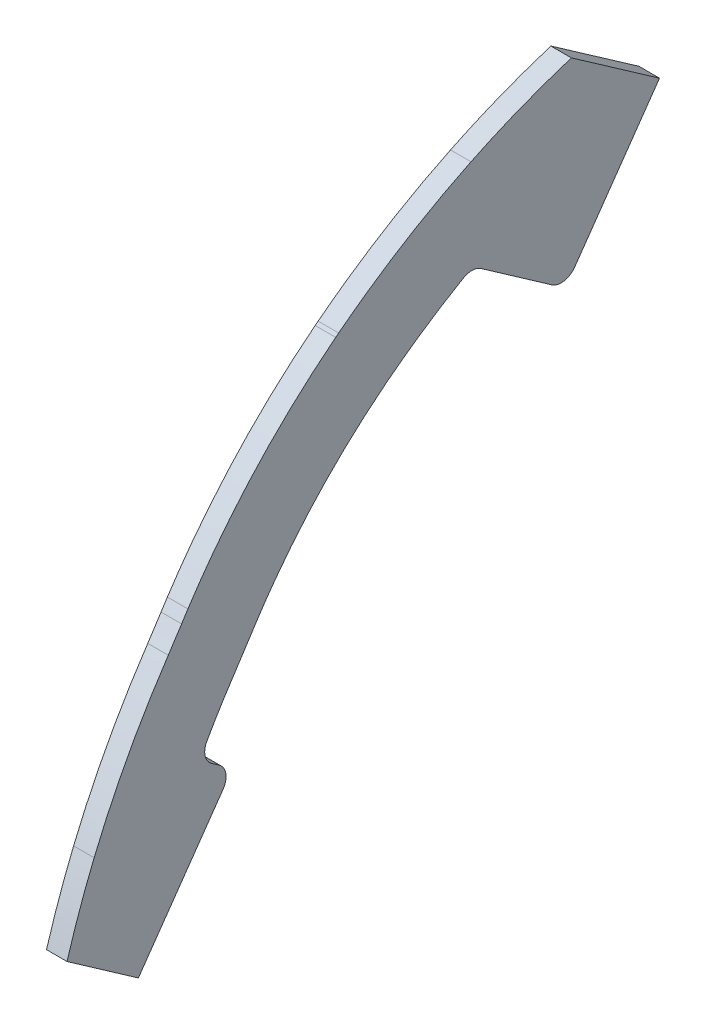
ISO-10303-21;
HEADER;
FILE_DESCRIPTION(('STEP AP214'),'2;1');
FILE_NAME('part.step','',(''),(''),'','','');
FILE_SCHEMA(('AUTOMOTIVE_DESIGN { 1 0 10303 214 1 1 1 1 }'));
ENDSEC;
DATA;
#1=APPLICATION_CONTEXT('core data for automotive mechanical design processes');
#2=APPLICATION_PROTOCOL_DEFINITION('international standard','automotive_design',2000,#1);
#3=PRODUCT_CONTEXT('',#1,'mechanical');
#4=PRODUCT('Part','Part','',(#3));
#5=PRODUCT_RELATED_PRODUCT_CATEGORY('part','',(#4));
#6=PRODUCT_DEFINITION_FORMATION('','',#4);
#7=PRODUCT_DEFINITION_CONTEXT('part definition',#1,'design');
#8=PRODUCT_DEFINITION('design','',#6,#7);
#9=PRODUCT_DEFINITION_SHAPE('','',#8);
#10=(LENGTH_UNIT() NAMED_UNIT(*) SI_UNIT(.MILLI.,.METRE.));
#11=(NAMED_UNIT(*) PLANE_ANGLE_UNIT() SI_UNIT($,.RADIAN.));
#12=(NAMED_UNIT(*) SI_UNIT($,.STERADIAN.) SOLID_ANGLE_UNIT());
#13=UNCERTAINTY_MEASURE_WITH_UNIT(LENGTH_MEASURE(1.E-05),#10,'distance_accuracy_value','');
#14=(GEOMETRIC_REPRESENTATION_CONTEXT(3) GLOBAL_UNCERTAINTY_ASSIGNED_CONTEXT((#13)) GLOBAL_UNIT_ASSIGNED_CONTEXT((#10,
#11,#12)) REPRESENTATION_CONTEXT('',''));
#15=CARTESIAN_POINT('',(0.,0.,0.));
#16=DIRECTION('',(0.,0.,1.));
#17=DIRECTION('',(1.,0.,0.));
#18=AXIS2_PLACEMENT_3D('',#15,#16,#17);
#19=CARTESIAN_POINT('',(-1.5875,107.915935417137,86.5173654967509));
#20=CARTESIAN_POINT('',(-1.5875,101.90193271907,90.5708923696763));
#21=CARTESIAN_POINT('',(-1.5875,95.4836107019876,94.0088634744107));
#22=CARTESIAN_POINT('',(-1.5875,88.7800683957772,96.7767882945236));
#23=B_SPLINE_CURVE_WITH_KNOTS('',3,(#19,#20,#21,#22),.UNSPECIFIED.,.F.,.F.,(4,4),(0.,1.),.UNSPECIFIED.);
#24=DIRECTION('',(1.,0.,0.));
#25=VECTOR('',#24,1.);
#26=SURFACE_OF_LINEAR_EXTRUSION('',#23,#25);
#27=CARTESIAN_POINT('',(1.5875,107.915935417137,86.5173654967509));
#28=CARTESIAN_POINT('',(1.5875,105.504268415559,88.1428647674094));
#29=CARTESIAN_POINT('',(1.5875,103.027583663719,89.6693777929756));
#30=CARTESIAN_POINT('',(1.5875,100.493561306121,91.0933907325681));
#31=B_SPLINE_CURVE_WITH_KNOTS('',3,(#27,#28,#29,#30),.UNSPECIFIED.,.F.,.F.,(4,4),(0.,
0.401008633127777),.UNSPECIFIED.);
#32=CARTESIAN_POINT('',(1.5875,107.915935417137,86.5173654967509));
#33=VERTEX_POINT('',#32);
#34=CARTESIAN_POINT('',(1.5875,100.493569679058,91.0934056331087));
#35=VERTEX_POINT('',#34);
#36=EDGE_CURVE('E427',#33,#35,#31,.T.);
#37=ORIENTED_EDGE('',*,*,#36,.T.);
#38=DIRECTION('',(1.,0.,0.));
#39=VECTOR('',#38,1.);
#40=CARTESIAN_POINT('',(1.5875,100.493561306526,91.0933907323403));
#41=LINE('',#40,#39);
#42=CARTESIAN_POINT('',(-1.5875,100.493569679058,91.0934056331087));
#43=VERTEX_POINT('',#42);
#44=EDGE_CURVE('E63',#35,#43,#41,.F.);
#45=ORIENTED_EDGE('',*,*,#44,.T.);
#46=CARTESIAN_POINT('',(-1.5875,100.493561305716,91.093390732796));
#47=CARTESIAN_POINT('',(-1.5875,103.027583663455,89.6693777931384));
#48=CARTESIAN_POINT('',(-1.5875,105.50426841543,88.1428647674961));
#49=CARTESIAN_POINT('',(-1.5875,107.915935417137,86.5173654967509));
#50=B_SPLINE_CURVE_WITH_KNOTS('',3,(#46,#47,#48,#49),.UNSPECIFIED.,.F.,.F.,(4,4),(0.,
0.401008633149162),.UNSPECIFIED.);
#51=CARTESIAN_POINT('',(-1.5875,107.915935417137,86.5173654967509));
#52=VERTEX_POINT('',#51);
#53=EDGE_CURVE('E373',#52,#43,#50,.F.);
#54=ORIENTED_EDGE('',*,*,#53,.F.);
#55=DIRECTION('',(1.,0.,0.));
#56=VECTOR('',#55,1.);
#57=CARTESIAN_POINT('',(-1.5875,107.915935417137,86.5173654967509));
#58=LINE('',#57,#56);
#59=EDGE_CURVE('E415',#52,#33,#58,.T.);
#60=ORIENTED_EDGE('',*,*,#59,.T.);
#61=EDGE_LOOP('',(#37,#45,#54,#60));
#62=FACE_BOUND('',#61,.T.);
#63=ADVANCED_FACE('F41',(#62),#26,.F.);
#64=CARTESIAN_POINT('',(1.5875,93.6270317100952,108.515482712118));
#65=CARTESIAN_POINT('',(1.5875,88.0312485824802,110.826008494565));
#66=CARTESIAN_POINT('',(1.5875,82.2656921555576,112.729048559774));
#67=CARTESIAN_POINT('',(1.5875,76.3893372673394,114.202129114204));
#68=(BOUNDED_CURVE() B_SPLINE_CURVE(3,(#64,#65,#66,#67),.UNSPECIFIED.,.F.,
.F.) B_SPLINE_CURVE_WITH_KNOTS((4,4),(0.,1.),
.UNSPECIFIED.) CURVE() GEOMETRIC_REPRESENTATION_ITEM() RATIONAL_B_SPLINE_CURVE((1.,1.,1.,1.)) REPRESENTATION_ITEM(''));
#69=DIRECTION('',(-1.,0.,0.));
#70=VECTOR('',#69,1.);
#71=SURFACE_OF_LINEAR_EXTRUSION('',#68,#70);
#72=DIRECTION('',(-1.,0.,0.));
#73=VECTOR('',#72,1.);
#74=CARTESIAN_POINT('',(2.2225,81.825546879038,112.707408993808));
#75=LINE('',#74,#73);
#76=CARTESIAN_POINT('',(1.5875,81.825546879038,112.707408993808));
#77=VERTEX_POINT('',#76);
#78=CARTESIAN_POINT('',(-1.5875,81.825546879038,112.707408993808));
#79=VERTEX_POINT('',#78);
#80=EDGE_CURVE('E208',#77,#79,#75,.T.);
#81=ORIENTED_EDGE('',*,*,#80,.F.);
#82=CARTESIAN_POINT('',(1.5875,93.627031710095,108.515482712118));
#83=VERTEX_POINT('',#82);
#84=EDGE_CURVE('E625',#83,#77,#68,.T.);
#85=ORIENTED_EDGE('',*,*,#84,.F.);
#86=DIRECTION('',(-1.,0.,0.));
#87=VECTOR('',#86,1.);
#88=CARTESIAN_POINT('',(1.5875,93.627031710095,108.515482712118));
#89=LINE('',#88,#87);
#90=CARTESIAN_POINT('',(-1.5875,93.627031710095,108.515482712118));
#91=VERTEX_POINT('',#90);
#92=EDGE_CURVE('E618',#83,#91,#89,.T.);
#93=ORIENTED_EDGE('',*,*,#92,.T.);
#94=CARTESIAN_POINT('',(-1.5875,93.6270317100952,108.515482712118));
#95=CARTESIAN_POINT('',(-1.5875,88.0312485824802,110.826008494565));
#96=CARTESIAN_POINT('',(-1.5875,82.2656921555576,112.729048559774));
#97=CARTESIAN_POINT('',(-1.5875,76.3893372673394,114.202129114204));
#98=(BOUNDED_CURVE() B_SPLINE_CURVE(3,(#94,#95,#96,#97),.UNSPECIFIED.,.F.,
.F.) B_SPLINE_CURVE_WITH_KNOTS((4,4),(0.,1.),
.UNSPECIFIED.) CURVE() GEOMETRIC_REPRESENTATION_ITEM() RATIONAL_B_SPLINE_CURVE((1.,1.,1.,1.)) REPRESENTATION_ITEM(''));
#99=EDGE_CURVE('E603',#91,#79,#98,.T.);
#100=ORIENTED_EDGE('',*,*,#99,.T.);
#101=EDGE_LOOP('',(#81,#85,#93,#100));
#102=FACE_BOUND('',#101,.T.);
#103=ADVANCED_FACE('F337',(#102),#71,.F.);
#104=CARTESIAN_POINT('',(1.5875,0.,0.));
#105=DIRECTION('',(1.,0.,0.));
#106=DIRECTION('',(0.,0.,-1.));
#107=AXIS2_PLACEMENT_3D('',#104,#105,#106);
#108=PLANE('',#107);
#109=DIRECTION('',(0.,0.819152044288991,-0.573576436351047));
#110=VECTOR('',#109,1.);
#111=CARTESIAN_POINT('',(1.5875,72.1527943640414,103.044869451879));
#112=LINE('',#111,#110);
#113=CARTESIAN_POINT('',(1.5875,74.103391567662,101.679047281967));
#114=VERTEX_POINT('',#113);
#115=CARTESIAN_POINT('',(1.5875,92.8292159019509,88.5670832278332));
#116=VERTEX_POINT('',#115);
#117=EDGE_CURVE('E223',#114,#116,#112,.T.);
#118=ORIENTED_EDGE('',*,*,#117,.T.);
#119=CARTESIAN_POINT('',(1.5875,94.2861000502826,90.6477294203273));
#120=DIRECTION('',(1.,0.,0.));
#121=DIRECTION('',(0.,0.,-1.));
#122=AXIS2_PLACEMENT_3D('',#119,#120,#121);
#123=CIRCLE('',#122,2.54);
#124=CARTESIAN_POINT('',(1.5875,96.3667462427766,89.1908452719956));
#125=VERTEX_POINT('',#124);
#126=EDGE_CURVE('E260',#116,#125,#123,.T.);
#127=ORIENTED_EDGE('',*,*,#126,.T.);
#128=DIRECTION('',(0.,0.573576436351047,0.819152044288991));
#129=VECTOR('',#128,1.);
#130=CARTESIAN_POINT('',(1.5875,22.7570677304036,-15.9346703723775));
#131=LINE('',#130,#129);
#132=CARTESIAN_POINT('',(1.5875,97.1685641585946,90.3359599302412));
#133=VERTEX_POINT('',#132);
#134=EDGE_CURVE('E230',#125,#133,#131,.T.);
#135=ORIENTED_EDGE('',*,*,#134,.T.);
#136=CARTESIAN_POINT('',(1.5875,99.2492103510886,88.8790757819095));
#137=DIRECTION('',(1.,0.,0.));
#138=DIRECTION('',(0.,0.,-1.));
#139=AXIS2_PLACEMENT_3D('',#136,#137,#138);
#140=CIRCLE('',#139,2.54);
#141=EDGE_CURVE('E50',#133,#35,#140,.F.);
#142=ORIENTED_EDGE('',*,*,#141,.T.);
#143=ORIENTED_EDGE('',*,*,#36,.F.);
#144=CARTESIAN_POINT('',(1.5875,111.419873636231,84.2359800322319));
#145=CARTESIAN_POINT('',(1.5875,110.239821867848,84.9777158691664));
#146=CARTESIAN_POINT('',(1.5875,109.071717042518,85.7383516115718));
#147=CARTESIAN_POINT('',(1.5875,107.915935417137,86.5173654967509));
#148=B_SPLINE_CURVE_WITH_KNOTS('',3,(#144,#145,#146,#147),.UNSPECIFIED.,.F.,.F.,(4,4),(0.,1.),.UNSPECIFIED.);
#149=CARTESIAN_POINT('',(1.5875,111.419873630809,84.2359800236039));
#150=VERTEX_POINT('',#149);
#151=EDGE_CURVE('E458',#150,#33,#148,.T.);
#152=ORIENTED_EDGE('',*,*,#151,.F.);
#153=CARTESIAN_POINT('',(1.5875,63.3548181596361,7.75744346018917));
#154=DIRECTION('',(1.,0.,0.));
#155=DIRECTION('',(0.,0.,-1.));
#156=AXIS2_PLACEMENT_3D('',#153,#154,#155);
#157=CIRCLE('',#156,90.3283793296906);
#158=CARTESIAN_POINT('',(1.5875,112.752426785171,83.3821244351593));
#159=VERTEX_POINT('',#158);
#160=EDGE_CURVE('E462',#159,#150,#157,.T.);
#161=ORIENTED_EDGE('',*,*,#160,.F.);
#162=CARTESIAN_POINT('',(1.5875,134.648212731086,63.3161076207928));
#163=CARTESIAN_POINT('',(1.5875,133.111065715405,65.2730000841247));
#164=CARTESIAN_POINT('',(1.5875,131.496958998954,67.1625498269264));
#165=CARTESIAN_POINT('',(1.5875,128.116527434619,70.8084525487401));
#166=CARTESIAN_POINT('',(1.5875,126.350531472869,72.5639139832837));
#167=CARTESIAN_POINT('',(1.5875,122.686873255702,75.9213637440467));
#168=CARTESIAN_POINT('',(1.5875,120.783823873835,77.5282254514782));
#169=CARTESIAN_POINT('',(1.5875,116.858338681864,80.5777798165875));
#170=CARTESIAN_POINT('',(1.5875,114.835703472595,82.021159666385));
#171=CARTESIAN_POINT('',(1.5875,112.752426785171,83.3821244351593));
#172=B_SPLINE_CURVE_WITH_KNOTS('',3,(#162,#163,#164,#165,#166,#167,#168,#169,#170,#171),
.UNSPECIFIED.,.F.,.F.,(4,2,2,2,4),(0.,0.25,0.5,0.75,1.),.UNSPECIFIED.);
#173=CARTESIAN_POINT('',(1.5875,134.64821273107,63.3161076207793));
#174=VERTEX_POINT('',#173);
#175=EDGE_CURVE('E470',#174,#159,#172,.T.);
#176=ORIENTED_EDGE('',*,*,#175,.F.);
#177=CARTESIAN_POINT('',(1.5875,134.967702358971,62.9074683058939));
#178=CARTESIAN_POINT('',(1.5875,134.861587146926,63.0439788888338));
#179=CARTESIAN_POINT('',(1.5875,134.755018246043,63.1801364229118));
#180=CARTESIAN_POINT('',(1.5875,134.64821273107,63.3161076207793));
#181=B_SPLINE_CURVE_WITH_KNOTS('',3,(#177,#178,#179,#180),.UNSPECIFIED.,.F.,.F.,(4,4),(0.,
0.000518710128432478),.UNSPECIFIED.);
#182=CARTESIAN_POINT('',(1.5875,134.967702358965,62.9074683058897));
#183=VERTEX_POINT('',#182);
#184=EDGE_CURVE('E547',#183,#174,#181,.T.);
#185=ORIENTED_EDGE('',*,*,#184,.F.);
#186=CARTESIAN_POINT('',(1.5875,142.718267340774,51.3892971924271));
#187=CARTESIAN_POINT('',(1.5875,140.4007841171,55.3985494249314));
#188=CARTESIAN_POINT('',(1.5875,137.811365186794,59.2492822621669));
#189=CARTESIAN_POINT('',(1.5875,134.967702358965,62.9074683058897));
#190=B_SPLINE_CURVE_WITH_KNOTS('',3,(#186,#187,#188,#189),.UNSPECIFIED.,.F.,.F.,(4,4),
(0.352340620145685,1.),.UNSPECIFIED.);
#191=CARTESIAN_POINT('',(1.5875,142.71829839717,51.3893151452742));
#192=VERTEX_POINT('',#191);
#193=EDGE_CURVE('E541',#192,#183,#190,.T.);
#194=ORIENTED_EDGE('',*,*,#193,.F.);
#195=CARTESIAN_POINT('',(1.5875,140.519213956038,50.1181700504458));
#196=DIRECTION('',(1.,0.,0.));
#197=DIRECTION('',(0.,0.,-1.));
#198=AXIS2_PLACEMENT_3D('',#195,#196,#197);
#199=CIRCLE('',#198,2.54);
#200=CARTESIAN_POINT('',(1.5875,142.599860148532,48.6612859021142));
#201=VERTEX_POINT('',#200);
#202=EDGE_CURVE('E273',#192,#201,#199,.F.);
#203=ORIENTED_EDGE('',*,*,#202,.T.);
#204=DIRECTION('',(0.,0.573576436351047,0.819152044288991));
#205=VECTOR('',#204,1.);
#206=CARTESIAN_POINT('',(1.5875,72.8226167372914,-50.9909451916081));
#207=LINE('',#206,#205);
#208=CARTESIAN_POINT('',(1.5875,134.953392567289,37.7409984673444));
#209=VERTEX_POINT('',#208);
#210=EDGE_CURVE('E214',#209,#201,#207,.T.);
#211=ORIENTED_EDGE('',*,*,#210,.F.);
#212=CARTESIAN_POINT('',(1.5875,137.034038759783,36.2841143190127));
#213=DIRECTION('',(1.,0.,0.));
#214=DIRECTION('',(0.,0.,-1.));
#215=AXIS2_PLACEMENT_3D('',#212,#213,#214);
#216=CIRCLE('',#215,2.54);
#217=CARTESIAN_POINT('',(1.5875,135.577154611452,34.2034681265187));
#218=VERTEX_POINT('',#217);
#219=EDGE_CURVE('E258',#209,#218,#216,.T.);
#220=ORIENTED_EDGE('',*,*,#219,.T.);
#221=DIRECTION('',(0.,-0.819152044288991,0.573576436351047));
#222=VECTOR('',#221,1.);
#223=CARTESIAN_POINT('',(1.5875,60.6738916816663,86.6512974664585));
#224=LINE('',#223,#222);
#225=CARTESIAN_POINT('',(1.5875,154.311490018694,21.0921927756359));
#226=VERTEX_POINT('',#225);
#227=EDGE_CURVE('E254',#226,#218,#224,.T.);
#228=ORIENTED_EDGE('',*,*,#227,.F.);
#229=DIRECTION('',(0.,-0.573576436351047,-0.819152044288991));
#230=VECTOR('',#229,1.);
#231=CARTESIAN_POINT('',(1.5875,93.6290786622317,-65.5597866749247));
#232=LINE('',#231,#230);
#233=CARTESIAN_POINT('',(1.5875,163.847355212807,34.722305017646));
#234=VERTEX_POINT('',#233);
#235=EDGE_CURVE('E793',#234,#226,#232,.T.);
#236=ORIENTED_EDGE('',*,*,#235,.F.);
#237=CARTESIAN_POINT('',(1.5875,169.18994581688,-8.75182657063168E-09));
#238=CARTESIAN_POINT('',(1.5875,169.189794661323,13.0067356295379));
#239=CARTESIAN_POINT('',(1.5875,167.235783234296,26.0150387116111));
#240=CARTESIAN_POINT('',(1.5875,163.333674627763,38.5625912605726));
#241=CARTESIAN_POINT('',(1.5875,157.690613368795,50.2374657150393));
#242=(BOUNDED_CURVE() B_SPLINE_CURVE(4,(#237,#238,#239,#240,#241),.UNSPECIFIED.,.F.,
.F.) B_SPLINE_CURVE_WITH_KNOTS((5,5),(0.,1.),
.UNSPECIFIED.) CURVE() GEOMETRIC_REPRESENTATION_ITEM() RATIONAL_B_SPLINE_CURVE((1.,1.,1.,1.,1.)) REPRESENTATION_ITEM(''));
#243=CARTESIAN_POINT('',(1.5875,157.690613368795,50.2374657150393));
#244=VERTEX_POINT('',#243);
#245=EDGE_CURVE('E606',#234,#244,#242,.T.);
#246=ORIENTED_EDGE('',*,*,#245,.T.);
#247=CARTESIAN_POINT('',(1.5875,157.690613368795,50.2374657150393));
#248=CARTESIAN_POINT('',(1.5875,154.185304199465,57.4895836956331));
#249=CARTESIAN_POINT('',(1.5875,149.921691806846,64.3634008386052));
#250=CARTESIAN_POINT('',(1.5875,144.994599704752,70.7017822344691));
#251=(BOUNDED_CURVE() B_SPLINE_CURVE(3,(#247,#248,#249,#250),.UNSPECIFIED.,.F.,
.F.) B_SPLINE_CURVE_WITH_KNOTS((4,4),(0.,1.),
.UNSPECIFIED.) CURVE() GEOMETRIC_REPRESENTATION_ITEM() RATIONAL_B_SPLINE_CURVE((1.,1.,1.,1.)) REPRESENTATION_ITEM(''));
#252=CARTESIAN_POINT('',(1.5875,144.994599704752,70.7017822344691));
#253=VERTEX_POINT('',#252);
#254=EDGE_CURVE('E649',#244,#253,#251,.T.);
#255=ORIENTED_EDGE('',*,*,#254,.T.);
#256=CARTESIAN_POINT('',(1.5875,144.994599704752,70.7017822344691));
#257=CARTESIAN_POINT('',(1.5875,144.875309775761,70.8552412666994));
#258=CARTESIAN_POINT('',(1.5875,144.755529232783,71.0083060491197));
#259=CARTESIAN_POINT('',(1.5875,144.635475433697,71.1611432299567));
#260=(BOUNDED_CURVE() B_SPLINE_CURVE(3,(#256,#257,#258,#259),.UNSPECIFIED.,.F.,
.F.) B_SPLINE_CURVE_WITH_KNOTS((4,4),(0.,1.),
.UNSPECIFIED.) CURVE() GEOMETRIC_REPRESENTATION_ITEM() RATIONAL_B_SPLINE_CURVE((1.,1.,1.,1.)) REPRESENTATION_ITEM(''));
#261=CARTESIAN_POINT('',(1.5875,144.635475433697,71.1611432299567));
#262=VERTEX_POINT('',#261);
#263=EDGE_CURVE('E740',#253,#262,#260,.T.);
#264=ORIENTED_EDGE('',*,*,#263,.T.);
#265=CARTESIAN_POINT('',(1.5875,144.635475433697,71.1611432299567));
#266=CARTESIAN_POINT('',(1.5875,137.608784490994,80.1065976384552));
#267=CARTESIAN_POINT('',(1.5875,129.14774479477,87.841288267326));
#268=CARTESIAN_POINT('',(1.5875,119.697960171294,94.0146013861083));
#269=(BOUNDED_CURVE() B_SPLINE_CURVE(3,(#265,#266,#267,#268),.UNSPECIFIED.,.F.,
.F.) B_SPLINE_CURVE_WITH_KNOTS((4,4),(0.,1.),
.UNSPECIFIED.) CURVE() GEOMETRIC_REPRESENTATION_ITEM() RATIONAL_B_SPLINE_CURVE((1.,1.,1.,1.)) REPRESENTATION_ITEM(''));
#270=CARTESIAN_POINT('',(1.5875,119.697960171294,94.0146013861083));
#271=VERTEX_POINT('',#270);
#272=EDGE_CURVE('E735',#262,#271,#269,.T.);
#273=ORIENTED_EDGE('',*,*,#272,.T.);
#274=CARTESIAN_POINT('',(1.5875,63.3548181596361,7.75744346018917));
#275=DIRECTION('',(1.,0.,0.));
#276=DIRECTION('',(0.,0.,-1.));
#277=AXIS2_PLACEMENT_3D('',#274,#275,#276);
#278=CIRCLE('',#277,103.0283793195);
#279=CARTESIAN_POINT('',(1.5875,118.178380489188,94.9883093202763));
#280=VERTEX_POINT('',#279);
#281=EDGE_CURVE('E739',#271,#280,#278,.T.);
#282=ORIENTED_EDGE('',*,*,#281,.T.);
#283=CARTESIAN_POINT('',(1.5875,118.178380489188,94.9883093202763));
#284=CARTESIAN_POINT('',(1.5875,117.116005214424,95.6560781713368));
#285=CARTESIAN_POINT('',(1.5875,116.060431913398,96.3433169268643));
#286=CARTESIAN_POINT('',(1.5875,115.014111075737,97.0485526244997));
#287=(BOUNDED_CURVE() B_SPLINE_CURVE(3,(#283,#284,#285,#286),.UNSPECIFIED.,.F.,
.F.) B_SPLINE_CURVE_WITH_KNOTS((4,4),(0.,1.),
.UNSPECIFIED.) CURVE() GEOMETRIC_REPRESENTATION_ITEM() RATIONAL_B_SPLINE_CURVE((1.,1.,1.,1.)) REPRESENTATION_ITEM(''));
#288=CARTESIAN_POINT('',(1.5875,115.014111075737,97.0485526244997));
#289=VERTEX_POINT('',#288);
#290=EDGE_CURVE('E698',#280,#289,#287,.T.);
#291=ORIENTED_EDGE('',*,*,#290,.T.);
#292=CARTESIAN_POINT('',(1.5875,115.014111075737,97.0485526244998));
#293=CARTESIAN_POINT('',(1.5875,108.292402496115,101.579083741193));
#294=CARTESIAN_POINT('',(1.5875,101.116024349716,105.423241676263));
#295=CARTESIAN_POINT('',(1.5875,93.627031710095,108.515482712118));
#296=(BOUNDED_CURVE() B_SPLINE_CURVE(3,(#292,#293,#294,#295),.UNSPECIFIED.,.F.,
.F.) B_SPLINE_CURVE_WITH_KNOTS((4,4),(0.,1.),
.UNSPECIFIED.) CURVE() GEOMETRIC_REPRESENTATION_ITEM() RATIONAL_B_SPLINE_CURVE((1.,1.,1.,1.)) REPRESENTATION_ITEM(''));
#297=EDGE_CURVE('E696',#289,#83,#296,.T.);
#298=ORIENTED_EDGE('',*,*,#297,.T.);
#299=ORIENTED_EDGE('',*,*,#84,.T.);
#300=DIRECTION('',(0.,-0.573576436351047,-0.819152044288991));
#301=VECTOR('',#300,1.);
#302=CARTESIAN_POINT('',(1.5875,1.95060580546317,-1.36582888906094));
#303=LINE('',#302,#301);
#304=EDGE_CURVE('E548',#77,#114,#303,.T.);
#305=ORIENTED_EDGE('',*,*,#304,.T.);
#306=EDGE_LOOP('',(#118,#127,#135,#142,#143,#152,#161,#176,#185,#194,#203,#211,#220,#228,#236,
#246,#255,#264,#273,#282,#291,#298,#299,#305));
#307=FACE_BOUND('',#306,.T.);
#308=ADVANCED_FACE('F299',(#307),#108,.T.);
#309=CARTESIAN_POINT('',(-1.5875,0.,0.));
#310=DIRECTION('',(1.,0.,0.));
#311=DIRECTION('',(0.,0.,-1.));
#312=AXIS2_PLACEMENT_3D('',#309,#310,#311);
#313=PLANE('',#312);
#314=DIRECTION('',(0.,0.573576436351047,0.819152044288991));
#315=VECTOR('',#314,1.);
#316=CARTESIAN_POINT('',(-1.5875,22.7570677304036,-15.9346703723775));
#317=LINE('',#316,#315);
#318=CARTESIAN_POINT('',(-1.5875,96.3667462427766,89.1908452719956));
#319=VERTEX_POINT('',#318);
#320=CARTESIAN_POINT('',(-1.5875,97.1685641585946,90.3359599302412));
#321=VERTEX_POINT('',#320);
#322=EDGE_CURVE('E231',#319,#321,#317,.T.);
#323=ORIENTED_EDGE('',*,*,#322,.F.);
#324=CARTESIAN_POINT('',(-1.5875,94.2861000502826,90.6477294203273));
#325=DIRECTION('',(1.,0.,0.));
#326=DIRECTION('',(0.,0.,-1.));
#327=AXIS2_PLACEMENT_3D('',#324,#325,#326);
#328=CIRCLE('',#327,2.54);
#329=CARTESIAN_POINT('',(-1.5875,92.8292159019509,88.5670832278332));
#330=VERTEX_POINT('',#329);
#331=EDGE_CURVE('E229',#319,#330,#328,.F.);
#332=ORIENTED_EDGE('',*,*,#331,.T.);
#333=DIRECTION('',(0.,0.819152044288991,-0.573576436351047));
#334=VECTOR('',#333,1.);
#335=CARTESIAN_POINT('',(-1.5875,72.1527943640414,103.044869451879));
#336=LINE('',#335,#334);
#337=CARTESIAN_POINT('',(-1.5875,74.1033829658194,101.679054001116));
#338=VERTEX_POINT('',#337);
#339=EDGE_CURVE('E220',#338,#330,#336,.T.);
#340=ORIENTED_EDGE('',*,*,#339,.F.);
#341=DIRECTION('',(0.,0.573576436351047,0.819152044288991));
#342=VECTOR('',#341,1.);
#343=CARTESIAN_POINT('',(-1.5875,1.95060580546317,-1.36582888906094));
#344=LINE('',#343,#342);
#345=EDGE_CURVE('E202',#338,#79,#344,.T.);
#346=ORIENTED_EDGE('',*,*,#345,.T.);
#347=ORIENTED_EDGE('',*,*,#99,.F.);
#348=CARTESIAN_POINT('',(-1.5875,115.014111075737,97.0485526244998));
#349=CARTESIAN_POINT('',(-1.5875,108.292402496115,101.579083741193));
#350=CARTESIAN_POINT('',(-1.5875,101.116024349716,105.423241676263));
#351=CARTESIAN_POINT('',(-1.5875,93.627031710095,108.515482712118));
#352=(BOUNDED_CURVE() B_SPLINE_CURVE(3,(#348,#349,#350,#351),.UNSPECIFIED.,.F.,
.F.) B_SPLINE_CURVE_WITH_KNOTS((4,4),(0.,1.),
.UNSPECIFIED.) CURVE() GEOMETRIC_REPRESENTATION_ITEM() RATIONAL_B_SPLINE_CURVE((1.,1.,1.,1.)) REPRESENTATION_ITEM(''));
#353=CARTESIAN_POINT('',(-1.5875,115.014111075737,97.0485526244997));
#354=VERTEX_POINT('',#353);
#355=EDGE_CURVE('E607',#354,#91,#352,.T.);
#356=ORIENTED_EDGE('',*,*,#355,.F.);
#357=CARTESIAN_POINT('',(-1.5875,118.178380489188,94.9883093202763));
#358=CARTESIAN_POINT('',(-1.5875,117.116005214424,95.6560781713368));
#359=CARTESIAN_POINT('',(-1.5875,116.060431913398,96.3433169268643));
#360=CARTESIAN_POINT('',(-1.5875,115.014111075737,97.0485526244997));
#361=(BOUNDED_CURVE() B_SPLINE_CURVE(3,(#357,#358,#359,#360),.UNSPECIFIED.,.F.,
.F.) B_SPLINE_CURVE_WITH_KNOTS((4,4),(0.,1.),
.UNSPECIFIED.) CURVE() GEOMETRIC_REPRESENTATION_ITEM() RATIONAL_B_SPLINE_CURVE((1.,1.,1.,1.)) REPRESENTATION_ITEM(''));
#362=CARTESIAN_POINT('',(-1.5875,118.178380489188,94.9883093202763));
#363=VERTEX_POINT('',#362);
#364=EDGE_CURVE('E680',#363,#354,#361,.T.);
#365=ORIENTED_EDGE('',*,*,#364,.F.);
#366=CARTESIAN_POINT('',(-1.5875,63.3548181596361,7.75744346018917));
#367=DIRECTION('',(1.,0.,0.));
#368=DIRECTION('',(0.,0.,-1.));
#369=AXIS2_PLACEMENT_3D('',#366,#367,#368);
#370=CIRCLE('',#369,103.0283793195);
#371=CARTESIAN_POINT('',(-1.5875,119.697960171294,94.0146013861083));
#372=VERTEX_POINT('',#371);
#373=EDGE_CURVE('E676',#372,#363,#370,.T.);
#374=ORIENTED_EDGE('',*,*,#373,.F.);
#375=CARTESIAN_POINT('',(-1.5875,144.635475433697,71.1611432299567));
#376=CARTESIAN_POINT('',(-1.5875,137.608784490994,80.1065976384552));
#377=CARTESIAN_POINT('',(-1.5875,129.14774479477,87.841288267326));
#378=CARTESIAN_POINT('',(-1.5875,119.697960171294,94.0146013861083));
#379=(BOUNDED_CURVE() B_SPLINE_CURVE(3,(#375,#376,#377,#378),.UNSPECIFIED.,.F.,
.F.) B_SPLINE_CURVE_WITH_KNOTS((4,4),(0.,1.),
.UNSPECIFIED.) CURVE() GEOMETRIC_REPRESENTATION_ITEM() RATIONAL_B_SPLINE_CURVE((1.,1.,1.,1.)) REPRESENTATION_ITEM(''));
#380=CARTESIAN_POINT('',(-1.5875,144.635475433697,71.1611432299567));
#381=VERTEX_POINT('',#380);
#382=EDGE_CURVE('E657',#381,#372,#379,.T.);
#383=ORIENTED_EDGE('',*,*,#382,.F.);
#384=CARTESIAN_POINT('',(-1.5875,144.994599704752,70.7017822344691));
#385=CARTESIAN_POINT('',(-1.5875,144.875309775761,70.8552412666994));
#386=CARTESIAN_POINT('',(-1.5875,144.755529232783,71.0083060491197));
#387=CARTESIAN_POINT('',(-1.5875,144.635475433697,71.1611432299567));
#388=(BOUNDED_CURVE() B_SPLINE_CURVE(3,(#384,#385,#386,#387),.UNSPECIFIED.,.F.,
.F.) B_SPLINE_CURVE_WITH_KNOTS((4,4),(0.,1.),
.UNSPECIFIED.) CURVE() GEOMETRIC_REPRESENTATION_ITEM() RATIONAL_B_SPLINE_CURVE((1.,1.,1.,1.)) REPRESENTATION_ITEM(''));
#389=CARTESIAN_POINT('',(-1.5875,144.994599704752,70.7017822344691));
#390=VERTEX_POINT('',#389);
#391=EDGE_CURVE('E655',#390,#381,#388,.T.);
#392=ORIENTED_EDGE('',*,*,#391,.F.);
#393=CARTESIAN_POINT('',(-1.5875,157.690613368795,50.2374657150393));
#394=CARTESIAN_POINT('',(-1.5875,154.185304199465,57.4895836956331));
#395=CARTESIAN_POINT('',(-1.5875,149.921691806846,64.3634008386052));
#396=CARTESIAN_POINT('',(-1.5875,144.994599704752,70.7017822344691));
#397=(BOUNDED_CURVE() B_SPLINE_CURVE(3,(#393,#394,#395,#396),.UNSPECIFIED.,.F.,
.F.) B_SPLINE_CURVE_WITH_KNOTS((4,4),(0.,1.),
.UNSPECIFIED.) CURVE() GEOMETRIC_REPRESENTATION_ITEM() RATIONAL_B_SPLINE_CURVE((1.,1.,1.,1.)) REPRESENTATION_ITEM(''));
#398=CARTESIAN_POINT('',(-1.5875,157.690613368795,50.2374657150393));
#399=VERTEX_POINT('',#398);
#400=EDGE_CURVE('E648',#399,#390,#397,.T.);
#401=ORIENTED_EDGE('',*,*,#400,.F.);
#402=CARTESIAN_POINT('',(-1.5875,169.18994581688,-8.75182657063168E-09));
#403=CARTESIAN_POINT('',(-1.5875,169.189794661323,13.0067356295379));
#404=CARTESIAN_POINT('',(-1.5875,167.235783234296,26.0150387116111));
#405=CARTESIAN_POINT('',(-1.5875,163.333674627763,38.5625912605726));
#406=CARTESIAN_POINT('',(-1.5875,157.690613368795,50.2374657150393));
#407=(BOUNDED_CURVE() B_SPLINE_CURVE(4,(#402,#403,#404,#405,#406),.UNSPECIFIED.,.F.,
.F.) B_SPLINE_CURVE_WITH_KNOTS((5,5),(0.,1.),
.UNSPECIFIED.) CURVE() GEOMETRIC_REPRESENTATION_ITEM() RATIONAL_B_SPLINE_CURVE((1.,1.,1.,1.,1.)) REPRESENTATION_ITEM(''));
#408=CARTESIAN_POINT('',(-1.5875,163.847355212807,34.722305017646));
#409=VERTEX_POINT('',#408);
#410=EDGE_CURVE('E422',#409,#399,#407,.T.);
#411=ORIENTED_EDGE('',*,*,#410,.F.);
#412=DIRECTION('',(0.,0.573576436351047,0.819152044288991));
#413=VECTOR('',#412,1.);
#414=CARTESIAN_POINT('',(-1.5875,93.6290786622317,-65.5597866749247));
#415=LINE('',#414,#413);
#416=CARTESIAN_POINT('',(-1.5875,154.320009695778,21.0928747589566));
#417=VERTEX_POINT('',#416);
#418=EDGE_CURVE('E213',#417,#409,#415,.T.);
#419=ORIENTED_EDGE('',*,*,#418,.F.);
#420=DIRECTION('',(0.,-0.819152044288991,0.573576436351047));
#421=VECTOR('',#420,1.);
#422=CARTESIAN_POINT('',(-1.5875,60.6738916816663,86.6512974664585));
#423=LINE('',#422,#421);
#424=CARTESIAN_POINT('',(-1.5875,135.577154611452,34.2034681265187));
#425=VERTEX_POINT('',#424);
#426=EDGE_CURVE('E243',#417,#425,#423,.T.);
#427=ORIENTED_EDGE('',*,*,#426,.T.);
#428=CARTESIAN_POINT('',(-1.5875,137.034038759783,36.2841143190127));
#429=DIRECTION('',(1.,0.,0.));
#430=DIRECTION('',(0.,0.,-1.));
#431=AXIS2_PLACEMENT_3D('',#428,#429,#430);
#432=CIRCLE('',#431,2.54);
#433=CARTESIAN_POINT('',(-1.5875,134.953392567289,37.7409984673444));
#434=VERTEX_POINT('',#433);
#435=EDGE_CURVE('E303',#425,#434,#432,.F.);
#436=ORIENTED_EDGE('',*,*,#435,.T.);
#437=DIRECTION('',(0.,0.573576436351047,0.819152044288991));
#438=VECTOR('',#437,1.);
#439=CARTESIAN_POINT('',(-1.5875,72.8226167372914,-50.9909451916081));
#440=LINE('',#439,#438);
#441=CARTESIAN_POINT('',(-1.5875,142.599860148532,48.6612859021142));
#442=VERTEX_POINT('',#441);
#443=EDGE_CURVE('E307',#434,#442,#440,.T.);
#444=ORIENTED_EDGE('',*,*,#443,.T.);
#445=CARTESIAN_POINT('',(-1.5875,140.519213956038,50.1181700504458));
#446=DIRECTION('',(1.,0.,0.));
#447=DIRECTION('',(0.,0.,-1.));
#448=AXIS2_PLACEMENT_3D('',#445,#446,#447);
#449=CIRCLE('',#448,2.54);
#450=CARTESIAN_POINT('',(-1.5875,142.71829839717,51.3893151452742));
#451=VERTEX_POINT('',#450);
#452=EDGE_CURVE('E277',#442,#451,#449,.T.);
#453=ORIENTED_EDGE('',*,*,#452,.T.);
#454=CARTESIAN_POINT('',(-1.5875,134.967702358965,62.9074683058897));
#455=CARTESIAN_POINT('',(-1.5875,137.811365186581,59.2492822624407));
#456=CARTESIAN_POINT('',(-1.5875,140.400784116712,55.3985494255079));
#457=CARTESIAN_POINT('',(-1.5875,142.718267340253,51.3892971933275));
#458=B_SPLINE_CURVE_WITH_KNOTS('',3,(#454,#455,#456,#457),.UNSPECIFIED.,.F.,.F.,(4,4),
(0.352340620194166,1.),.UNSPECIFIED.);
#459=CARTESIAN_POINT('',(-1.5875,134.967702358965,62.9074683058897));
#460=VERTEX_POINT('',#459);
#461=EDGE_CURVE('E314',#451,#460,#458,.F.);
#462=ORIENTED_EDGE('',*,*,#461,.T.);
#463=CARTESIAN_POINT('',(-1.5875,134.64821273107,63.3161076207793));
#464=CARTESIAN_POINT('',(-1.5875,134.755018246043,63.1801364229118));
#465=CARTESIAN_POINT('',(-1.5875,134.861587146926,63.0439788888338));
#466=CARTESIAN_POINT('',(-1.5875,134.967702358971,62.9074683058939));
#467=B_SPLINE_CURVE_WITH_KNOTS('',3,(#463,#464,#465,#466),.UNSPECIFIED.,.F.,.F.,(4,4),(0.,
0.000518710128432478),.UNSPECIFIED.);
#468=CARTESIAN_POINT('',(-1.5875,134.64821273107,63.3161076207793));
#469=VERTEX_POINT('',#468);
#470=EDGE_CURVE('E553',#460,#469,#467,.F.);
#471=ORIENTED_EDGE('',*,*,#470,.T.);
#472=CARTESIAN_POINT('',(-1.5875,112.752426785171,83.3821244351593));
#473=CARTESIAN_POINT('',(-1.5875,114.835703472595,82.021159666385));
#474=CARTESIAN_POINT('',(-1.5875,116.858338681864,80.5777798165875));
#475=CARTESIAN_POINT('',(-1.5875,120.783823873835,77.5282254514782));
#476=CARTESIAN_POINT('',(-1.5875,122.686873255702,75.9213637440467));
#477=CARTESIAN_POINT('',(-1.5875,126.350531472869,72.5639139832837));
#478=CARTESIAN_POINT('',(-1.5875,128.116527434619,70.8084525487401));
#479=CARTESIAN_POINT('',(-1.5875,131.496958998954,67.1625498269264));
#480=CARTESIAN_POINT('',(-1.5875,133.111065715405,65.2730000841247));
#481=CARTESIAN_POINT('',(-1.5875,134.648212731086,63.3161076207928));
#482=B_SPLINE_CURVE_WITH_KNOTS('',3,(#472,#473,#474,#475,#476,#477,#478,#479,#480,#481),
.UNSPECIFIED.,.F.,.F.,(4,2,2,2,4),(0.,0.25,0.5,0.75,1.),.UNSPECIFIED.);
#483=CARTESIAN_POINT('',(-1.5875,112.752426785171,83.3821244351593));
#484=VERTEX_POINT('',#483);
#485=EDGE_CURVE('E452',#469,#484,#482,.F.);
#486=ORIENTED_EDGE('',*,*,#485,.T.);
#487=CARTESIAN_POINT('',(-1.5875,63.3548181596361,7.75744346018917));
#488=DIRECTION('',(1.,0.,0.));
#489=DIRECTION('',(0.,0.,-1.));
#490=AXIS2_PLACEMENT_3D('',#487,#488,#489);
#491=CIRCLE('',#490,90.3283793296906);
#492=CARTESIAN_POINT('',(-1.5875,111.419873630809,84.2359800236039));
#493=VERTEX_POINT('',#492);
#494=EDGE_CURVE('E450',#484,#493,#491,.T.);
#495=ORIENTED_EDGE('',*,*,#494,.T.);
#496=CARTESIAN_POINT('',(-1.5875,107.915935417137,86.5173654967509));
#497=CARTESIAN_POINT('',(-1.5875,109.071717042518,85.7383516115718));
#498=CARTESIAN_POINT('',(-1.5875,110.239821867848,84.9777158691664));
#499=CARTESIAN_POINT('',(-1.5875,111.419873636231,84.2359800322319));
#500=B_SPLINE_CURVE_WITH_KNOTS('',3,(#496,#497,#498,#499),.UNSPECIFIED.,.F.,.F.,(4,4),(0.,1.),.UNSPECIFIED.);
#501=EDGE_CURVE('E365',#493,#52,#500,.F.);
#502=ORIENTED_EDGE('',*,*,#501,.T.);
#503=ORIENTED_EDGE('',*,*,#53,.T.);
#504=CARTESIAN_POINT('',(-1.5875,99.2492103510886,88.8790757819095));
#505=DIRECTION('',(1.,0.,0.));
#506=DIRECTION('',(0.,0.,-1.));
#507=AXIS2_PLACEMENT_3D('',#504,#505,#506);
#508=CIRCLE('',#507,2.54);
#509=EDGE_CURVE('E11',#43,#321,#508,.T.);
#510=ORIENTED_EDGE('',*,*,#509,.T.);
#511=EDGE_LOOP('',(#323,#332,#340,#346,#347,#356,#365,#374,#383,#392,#401,#411,#419,#427,#436,
#444,#453,#462,#471,#486,#495,#502,#503,#510));
#512=FACE_BOUND('',#511,.T.);
#513=ADVANCED_FACE('F228',(#512),#313,.F.);
#514=DIRECTION('',(-1.,0.,0.));
#515=VECTOR('',#514,1.);
#516=SURFACE_OF_LINEAR_EXTRUSION('',#242,#515);
#517=ORIENTED_EDGE('',*,*,#245,.F.);
#518=DIRECTION('',(-1.,0.,0.));
#519=VECTOR('',#518,1.);
#520=CARTESIAN_POINT('',(2.2225,163.847355212807,34.722305017646));
#521=LINE('',#520,#519);
#522=EDGE_CURVE('E794',#234,#409,#521,.T.);
#523=ORIENTED_EDGE('',*,*,#522,.T.);
#524=ORIENTED_EDGE('',*,*,#410,.T.);
#525=DIRECTION('',(-1.,0.,0.));
#526=VECTOR('',#525,1.);
#527=CARTESIAN_POINT('',(1.5875,157.690613368795,50.2374657150393));
#528=LINE('',#527,#526);
#529=EDGE_CURVE('E322',#244,#399,#528,.T.);
#530=ORIENTED_EDGE('',*,*,#529,.F.);
#531=EDGE_LOOP('',(#517,#523,#524,#530));
#532=FACE_BOUND('',#531,.T.);
#533=ADVANCED_FACE('F334',(#532),#516,.F.);
#534=DIRECTION('',(-1.,0.,0.));
#535=VECTOR('',#534,1.);
#536=SURFACE_OF_LINEAR_EXTRUSION('',#251,#535);
#537=ORIENTED_EDGE('',*,*,#400,.T.);
#538=DIRECTION('',(-1.,0.,0.));
#539=VECTOR('',#538,1.);
#540=CARTESIAN_POINT('',(1.5875,144.994599704752,70.7017822344691));
#541=LINE('',#540,#539);
#542=EDGE_CURVE('E636',#253,#390,#541,.T.);
#543=ORIENTED_EDGE('',*,*,#542,.F.);
#544=ORIENTED_EDGE('',*,*,#254,.F.);
#545=ORIENTED_EDGE('',*,*,#529,.T.);
#546=EDGE_LOOP('',(#537,#543,#544,#545));
#547=FACE_BOUND('',#546,.T.);
#548=ADVANCED_FACE('F647',(#547),#536,.F.);
#549=DIRECTION('',(-1.,0.,0.));
#550=VECTOR('',#549,1.);
#551=SURFACE_OF_LINEAR_EXTRUSION('',#260,#550);
#552=ORIENTED_EDGE('',*,*,#391,.T.);
#553=DIRECTION('',(-1.,0.,0.));
#554=VECTOR('',#553,1.);
#555=CARTESIAN_POINT('',(1.5875,144.635475433697,71.1611432299567));
#556=LINE('',#555,#554);
#557=EDGE_CURVE('E634',#262,#381,#556,.T.);
#558=ORIENTED_EDGE('',*,*,#557,.F.);
#559=ORIENTED_EDGE('',*,*,#263,.F.);
#560=ORIENTED_EDGE('',*,*,#542,.T.);
#561=EDGE_LOOP('',(#552,#558,#559,#560));
#562=FACE_BOUND('',#561,.T.);
#563=ADVANCED_FACE('F731',(#562),#551,.F.);
#564=DIRECTION('',(-1.,0.,0.));
#565=VECTOR('',#564,1.);
#566=SURFACE_OF_LINEAR_EXTRUSION('',#269,#565);
#567=ORIENTED_EDGE('',*,*,#382,.T.);
#568=DIRECTION('',(-1.,0.,0.));
#569=VECTOR('',#568,1.);
#570=CARTESIAN_POINT('',(1.5875,119.697960171294,94.0146013861083));
#571=LINE('',#570,#569);
#572=EDGE_CURVE('E631',#271,#372,#571,.T.);
#573=ORIENTED_EDGE('',*,*,#572,.F.);
#574=ORIENTED_EDGE('',*,*,#272,.F.);
#575=ORIENTED_EDGE('',*,*,#557,.T.);
#576=EDGE_LOOP('',(#567,#573,#574,#575));
#577=FACE_BOUND('',#576,.T.);
#578=ADVANCED_FACE('F726',(#577),#566,.F.);
#579=CARTESIAN_POINT('',(1.5875,63.3548181596361,7.75744346018917));
#580=DIRECTION('',(-1.,0.,0.));
#581=DIRECTION('',(0.,0.,1.));
#582=AXIS2_PLACEMENT_3D('',#579,#580,#581);
#583=CYLINDRICAL_SURFACE('',#582,103.0283793195);
#584=ORIENTED_EDGE('',*,*,#373,.T.);
#585=DIRECTION('',(-1.,0.,0.));
#586=VECTOR('',#585,1.);
#587=CARTESIAN_POINT('',(1.5875,118.178380489188,94.9883093202763));
#588=LINE('',#587,#586);
#589=EDGE_CURVE('E628',#280,#363,#588,.T.);
#590=ORIENTED_EDGE('',*,*,#589,.F.);
#591=ORIENTED_EDGE('',*,*,#281,.F.);
#592=ORIENTED_EDGE('',*,*,#572,.T.);
#593=EDGE_LOOP('',(#584,#590,#591,#592));
#594=FACE_BOUND('',#593,.T.);
#595=ADVANCED_FACE('F723',(#594),#583,.T.);
#596=DIRECTION('',(-1.,0.,0.));
#597=VECTOR('',#596,1.);
#598=SURFACE_OF_LINEAR_EXTRUSION('',#287,#597);
#599=ORIENTED_EDGE('',*,*,#364,.T.);
#600=DIRECTION('',(-1.,0.,0.));
#601=VECTOR('',#600,1.);
#602=CARTESIAN_POINT('',(1.5875,115.014111075737,97.0485526244997));
#603=LINE('',#602,#601);
#604=EDGE_CURVE('E624',#289,#354,#603,.T.);
#605=ORIENTED_EDGE('',*,*,#604,.F.);
#606=ORIENTED_EDGE('',*,*,#290,.F.);
#607=ORIENTED_EDGE('',*,*,#589,.T.);
#608=EDGE_LOOP('',(#599,#605,#606,#607));
#609=FACE_BOUND('',#608,.T.);
#610=ADVANCED_FACE('F720',(#609),#598,.F.);
#611=DIRECTION('',(-1.,0.,0.));
#612=VECTOR('',#611,1.);
#613=SURFACE_OF_LINEAR_EXTRUSION('',#296,#612);
#614=ORIENTED_EDGE('',*,*,#355,.T.);
#615=ORIENTED_EDGE('',*,*,#92,.F.);
#616=ORIENTED_EDGE('',*,*,#297,.F.);
#617=ORIENTED_EDGE('',*,*,#604,.T.);
#618=EDGE_LOOP('',(#614,#615,#616,#617));
#619=FACE_BOUND('',#618,.T.);
#620=ADVANCED_FACE('F692',(#619),#613,.F.);
#621=CARTESIAN_POINT('',(-1.5875,111.419873636231,84.2359800322319));
#622=CARTESIAN_POINT('',(-1.5875,110.239821867848,84.9777158691664));
#623=CARTESIAN_POINT('',(-1.5875,109.071717042518,85.7383516115718));
#624=CARTESIAN_POINT('',(-1.5875,107.915935417137,86.5173654967509));
#625=B_SPLINE_CURVE_WITH_KNOTS('',3,(#621,#622,#623,#624),.UNSPECIFIED.,.F.,.F.,(4,4),(0.,1.),.UNSPECIFIED.);
#626=DIRECTION('',(1.,0.,0.));
#627=VECTOR('',#626,1.);
#628=SURFACE_OF_LINEAR_EXTRUSION('',#625,#627);
#629=ORIENTED_EDGE('',*,*,#151,.T.);
#630=ORIENTED_EDGE('',*,*,#59,.F.);
#631=ORIENTED_EDGE('',*,*,#501,.F.);
#632=DIRECTION('',(1.,0.,0.));
#633=VECTOR('',#632,1.);
#634=CARTESIAN_POINT('',(-1.5875,111.419873630809,84.2359800236039));
#635=LINE('',#634,#633);
#636=EDGE_CURVE('E423',#493,#150,#635,.T.);
#637=ORIENTED_EDGE('',*,*,#636,.T.);
#638=EDGE_LOOP('',(#629,#630,#631,#637));
#639=FACE_BOUND('',#638,.T.);
#640=ADVANCED_FACE('F396',(#639),#628,.F.);
#641=CARTESIAN_POINT('',(-1.5875,63.3548181596361,7.75744346018917));
#642=DIRECTION('',(1.,0.,0.));
#643=DIRECTION('',(0.,0.,-1.));
#644=AXIS2_PLACEMENT_3D('',#641,#642,#643);
#645=CYLINDRICAL_SURFACE('',#644,90.3283793296906);
#646=ORIENTED_EDGE('',*,*,#160,.T.);
#647=ORIENTED_EDGE('',*,*,#636,.F.);
#648=ORIENTED_EDGE('',*,*,#494,.F.);
#649=DIRECTION('',(1.,0.,0.));
#650=VECTOR('',#649,1.);
#651=CARTESIAN_POINT('',(-1.5875,112.752426785171,83.3821244351593));
#652=LINE('',#651,#650);
#653=EDGE_CURVE('E447',#484,#159,#652,.T.);
#654=ORIENTED_EDGE('',*,*,#653,.T.);
#655=EDGE_LOOP('',(#646,#647,#648,#654));
#656=FACE_BOUND('',#655,.T.);
#657=ADVANCED_FACE('F492',(#656),#645,.F.);
#658=CARTESIAN_POINT('',(-1.5875,134.648212731086,63.3161076207928));
#659=CARTESIAN_POINT('',(-1.5875,133.111065715405,65.2730000841247));
#660=CARTESIAN_POINT('',(-1.5875,131.496958998954,67.1625498269264));
#661=CARTESIAN_POINT('',(-1.5875,128.116527434619,70.8084525487401));
#662=CARTESIAN_POINT('',(-1.5875,126.350531472869,72.5639139832837));
#663=CARTESIAN_POINT('',(-1.5875,122.686873255702,75.9213637440467));
#664=CARTESIAN_POINT('',(-1.5875,120.783823873835,77.5282254514782));
#665=CARTESIAN_POINT('',(-1.5875,116.858338681864,80.5777798165875));
#666=CARTESIAN_POINT('',(-1.5875,114.835703472595,82.021159666385));
#667=CARTESIAN_POINT('',(-1.5875,112.752426785171,83.3821244351593));
#668=B_SPLINE_CURVE_WITH_KNOTS('',3,(#658,#659,#660,#661,#662,#663,#664,#665,#666,#667),
.UNSPECIFIED.,.F.,.F.,(4,2,2,2,4),(0.,0.25,0.5,0.75,1.),.UNSPECIFIED.);
#669=DIRECTION('',(1.,0.,0.));
#670=VECTOR('',#669,1.);
#671=SURFACE_OF_LINEAR_EXTRUSION('',#668,#670);
#672=ORIENTED_EDGE('',*,*,#175,.T.);
#673=ORIENTED_EDGE('',*,*,#653,.F.);
#674=ORIENTED_EDGE('',*,*,#485,.F.);
#675=DIRECTION('',(1.,0.,0.));
#676=VECTOR('',#675,1.);
#677=CARTESIAN_POINT('',(-1.5875,134.64821273107,63.3161076207793));
#678=LINE('',#677,#676);
#679=EDGE_CURVE('E480',#469,#174,#678,.T.);
#680=ORIENTED_EDGE('',*,*,#679,.T.);
#681=EDGE_LOOP('',(#672,#673,#674,#680));
#682=FACE_BOUND('',#681,.T.);
#683=ADVANCED_FACE('F482',(#682),#671,.F.);
#684=CARTESIAN_POINT('',(-1.5875,134.967702358971,62.9074683058939));
#685=CARTESIAN_POINT('',(-1.5875,134.861587146926,63.0439788888338));
#686=CARTESIAN_POINT('',(-1.5875,134.755018246043,63.1801364229118));
#687=CARTESIAN_POINT('',(-1.5875,134.64821273107,63.3161076207793));
#688=B_SPLINE_CURVE_WITH_KNOTS('',3,(#684,#685,#686,#687),.UNSPECIFIED.,.F.,.F.,(4,4),(0.,
0.000518710128432478),.UNSPECIFIED.);
#689=DIRECTION('',(1.,0.,0.));
#690=VECTOR('',#689,1.);
#691=SURFACE_OF_LINEAR_EXTRUSION('',#688,#690);
#692=ORIENTED_EDGE('',*,*,#184,.T.);
#693=ORIENTED_EDGE('',*,*,#679,.F.);
#694=ORIENTED_EDGE('',*,*,#470,.F.);
#695=DIRECTION('',(1.,0.,0.));
#696=VECTOR('',#695,1.);
#697=CARTESIAN_POINT('',(-1.5875,134.967702358965,62.9074683058897));
#698=LINE('',#697,#696);
#699=EDGE_CURVE('E375',#460,#183,#698,.T.);
#700=ORIENTED_EDGE('',*,*,#699,.T.);
#701=EDGE_LOOP('',(#692,#693,#694,#700));
#702=FACE_BOUND('',#701,.T.);
#703=ADVANCED_FACE('F491',(#702),#691,.F.);
#704=CARTESIAN_POINT('',(-1.5875,146.256255065299,44.7106718716546));
#705=CARTESIAN_POINT('',(-1.5875,143.142937334555,51.1518005720792));
#706=CARTESIAN_POINT('',(-1.5875,139.358378872394,57.2591504438899));
#707=CARTESIAN_POINT('',(-1.5875,134.967702358965,62.9074683058897));
#708=B_SPLINE_CURVE_WITH_KNOTS('',3,(#704,#705,#706,#707),.UNSPECIFIED.,.F.,.F.,(4,4),(0.,1.),.UNSPECIFIED.);
#709=DIRECTION('',(1.,0.,0.));
#710=VECTOR('',#709,1.);
#711=SURFACE_OF_LINEAR_EXTRUSION('',#708,#710);
#712=ORIENTED_EDGE('',*,*,#461,.F.);
#713=DIRECTION('',(1.,0.,0.));
#714=VECTOR('',#713,1.);
#715=CARTESIAN_POINT('',(-1.5875,142.718267341294,51.3892971915268));
#716=LINE('',#715,#714);
#717=EDGE_CURVE('E270',#451,#192,#716,.T.);
#718=ORIENTED_EDGE('',*,*,#717,.T.);
#719=ORIENTED_EDGE('',*,*,#193,.T.);
#720=ORIENTED_EDGE('',*,*,#699,.F.);
#721=EDGE_LOOP('',(#712,#718,#719,#720));
#722=FACE_BOUND('',#721,.T.);
#723=ADVANCED_FACE('F518',(#722),#711,.F.);
#724=CARTESIAN_POINT('',(2.2225,93.6290786622317,-65.5597866749247));
#725=DIRECTION('',(0.,-0.819152044288991,0.573576436351047));
#726=DIRECTION('',(0.,-0.573576436351047,-0.819152044288991));
#727=AXIS2_PLACEMENT_3D('',#724,#725,#726);
#728=PLANE('',#727);
#729=ORIENTED_EDGE('',*,*,#235,.T.);
#730=DIRECTION('',(1.,0.,0.));
#731=VECTOR('',#730,1.);
#732=CARTESIAN_POINT('',(-1.5875,154.302970343898,21.0915107915338));
#733=LINE('',#732,#731);
#734=EDGE_CURVE('E225',#226,#417,#733,.F.);
#735=ORIENTED_EDGE('',*,*,#734,.T.);
#736=ORIENTED_EDGE('',*,*,#418,.T.);
#737=ORIENTED_EDGE('',*,*,#522,.F.);
#738=EDGE_LOOP('',(#729,#735,#736,#737));
#739=FACE_BOUND('',#738,.T.);
#740=ADVANCED_FACE('F521',(#739),#728,.F.);
#741=CARTESIAN_POINT('',(2.2225,1.95060580546317,-1.36582888906094));
#742=DIRECTION('',(0.,-0.819152044288991,0.573576436351047));
#743=DIRECTION('',(0.,-0.573576436351047,-0.819152044288991));
#744=AXIS2_PLACEMENT_3D('',#741,#742,#743);
#745=PLANE('',#744);
#746=ORIENTED_EDGE('',*,*,#80,.T.);
#747=ORIENTED_EDGE('',*,*,#345,.F.);
#748=DIRECTION('',(1.,0.,0.));
#749=VECTOR('',#748,1.);
#750=CARTESIAN_POINT('',(-1.5875,74.1034001695046,101.679040562818));
#751=LINE('',#750,#749);
#752=EDGE_CURVE('E205',#114,#338,#751,.F.);
#753=ORIENTED_EDGE('',*,*,#752,.F.);
#754=ORIENTED_EDGE('',*,*,#304,.F.);
#755=EDGE_LOOP('',(#746,#747,#753,#754));
#756=FACE_BOUND('',#755,.T.);
#757=ADVANCED_FACE('F204',(#756),#745,.T.);
#758=CARTESIAN_POINT('',(1.5875,72.8226167372914,-50.9909451916081));
#759=DIRECTION('',(0.,-0.819152044288991,0.573576436351047));
#760=DIRECTION('',(0.,-0.573576436351047,-0.819152044288991));
#761=AXIS2_PLACEMENT_3D('',#758,#759,#760);
#762=PLANE('',#761);
#763=ORIENTED_EDGE('',*,*,#443,.F.);
#764=DIRECTION('',(-1.,0.,0.));
#765=VECTOR('',#764,1.);
#766=CARTESIAN_POINT('',(1.5875,134.953392567289,37.7409984673444));
#767=LINE('',#766,#765);
#768=EDGE_CURVE('E268',#434,#209,#767,.F.);
#769=ORIENTED_EDGE('',*,*,#768,.T.);
#770=ORIENTED_EDGE('',*,*,#210,.T.);
#771=DIRECTION('',(1.,0.,0.));
#772=VECTOR('',#771,1.);
#773=CARTESIAN_POINT('',(1.5875,142.599860148532,48.6612859021142));
#774=LINE('',#773,#772);
#775=EDGE_CURVE('E266',#201,#442,#774,.F.);
#776=ORIENTED_EDGE('',*,*,#775,.T.);
#777=EDGE_LOOP('',(#763,#769,#770,#776));
#778=FACE_BOUND('',#777,.T.);
#779=ADVANCED_FACE('F807',(#778),#762,.T.);
#780=CARTESIAN_POINT('',(1.5875,60.6738916816663,86.6512974664585));
#781=DIRECTION('',(0.,-0.573576436351047,-0.819152044288991));
#782=DIRECTION('',(0.,0.819152044288991,-0.573576436351047));
#783=AXIS2_PLACEMENT_3D('',#780,#781,#782);
#784=PLANE('',#783);
#785=ORIENTED_EDGE('',*,*,#227,.T.);
#786=DIRECTION('',(-1.,0.,0.));
#787=VECTOR('',#786,1.);
#788=CARTESIAN_POINT('',(1.5875,135.577154611452,34.2034681265187));
#789=LINE('',#788,#787);
#790=EDGE_CURVE('E263',#218,#425,#789,.T.);
#791=ORIENTED_EDGE('',*,*,#790,.T.);
#792=ORIENTED_EDGE('',*,*,#426,.F.);
#793=ORIENTED_EDGE('',*,*,#734,.F.);
#794=EDGE_LOOP('',(#785,#791,#792,#793));
#795=FACE_BOUND('',#794,.T.);
#796=ADVANCED_FACE('F779',(#795),#784,.T.);
#797=CARTESIAN_POINT('',(1.5875,22.7570677304036,-15.9346703723775));
#798=DIRECTION('',(0.,-0.819152044288991,0.573576436351047));
#799=DIRECTION('',(0.,-0.573576436351047,-0.819152044288991));
#800=AXIS2_PLACEMENT_3D('',#797,#798,#799);
#801=PLANE('',#800);
#802=ORIENTED_EDGE('',*,*,#322,.T.);
#803=DIRECTION('',(-1.,0.,0.));
#804=VECTOR('',#803,1.);
#805=CARTESIAN_POINT('',(1.5875,97.1685641585946,90.3359599302412));
#806=LINE('',#805,#804);
#807=EDGE_CURVE('E281',#321,#133,#806,.F.);
#808=ORIENTED_EDGE('',*,*,#807,.T.);
#809=ORIENTED_EDGE('',*,*,#134,.F.);
#810=DIRECTION('',(-1.,0.,0.));
#811=VECTOR('',#810,1.);
#812=CARTESIAN_POINT('',(1.5875,96.3667462427766,89.1908452719956));
#813=LINE('',#812,#811);
#814=EDGE_CURVE('E224',#125,#319,#813,.T.);
#815=ORIENTED_EDGE('',*,*,#814,.T.);
#816=EDGE_LOOP('',(#802,#808,#809,#815));
#817=FACE_BOUND('',#816,.T.);
#818=ADVANCED_FACE('F294',(#817),#801,.F.);
#819=CARTESIAN_POINT('',(1.5875,72.1527943640414,103.044869451879));
#820=DIRECTION('',(0.,0.573576436351047,0.819152044288991));
#821=DIRECTION('',(0.,-0.819152044288991,0.573576436351047));
#822=AXIS2_PLACEMENT_3D('',#819,#820,#821);
#823=PLANE('',#822);
#824=ORIENTED_EDGE('',*,*,#339,.T.);
#825=DIRECTION('',(-1.,0.,0.));
#826=VECTOR('',#825,1.);
#827=CARTESIAN_POINT('',(1.5875,92.8292159019509,88.5670832278332));
#828=LINE('',#827,#826);
#829=EDGE_CURVE('E261',#330,#116,#828,.F.);
#830=ORIENTED_EDGE('',*,*,#829,.T.);
#831=ORIENTED_EDGE('',*,*,#117,.F.);
#832=ORIENTED_EDGE('',*,*,#752,.T.);
#833=EDGE_LOOP('',(#824,#830,#831,#832));
#834=FACE_BOUND('',#833,.T.);
#835=ADVANCED_FACE('F219',(#834),#823,.F.);
#836=CARTESIAN_POINT('',(1.5875,94.2861000502826,90.6477294203273));
#837=DIRECTION('',(-1.,0.,0.));
#838=DIRECTION('',(0.,0.,1.));
#839=AXIS2_PLACEMENT_3D('',#836,#837,#838);
#840=CYLINDRICAL_SURFACE('',#839,2.54);
#841=ORIENTED_EDGE('',*,*,#126,.F.);
#842=ORIENTED_EDGE('',*,*,#829,.F.);
#843=ORIENTED_EDGE('',*,*,#331,.F.);
#844=ORIENTED_EDGE('',*,*,#814,.F.);
#845=EDGE_LOOP('',(#841,#842,#843,#844));
#846=FACE_BOUND('',#845,.T.);
#847=ADVANCED_FACE('F302',(#846),#840,.T.);
#848=CARTESIAN_POINT('',(1.5875,137.034038759783,36.2841143190127));
#849=DIRECTION('',(-1.,0.,0.));
#850=DIRECTION('',(0.,0.,1.));
#851=AXIS2_PLACEMENT_3D('',#848,#849,#850);
#852=CYLINDRICAL_SURFACE('',#851,2.54);
#853=ORIENTED_EDGE('',*,*,#219,.F.);
#854=ORIENTED_EDGE('',*,*,#768,.F.);
#855=ORIENTED_EDGE('',*,*,#435,.F.);
#856=ORIENTED_EDGE('',*,*,#790,.F.);
#857=EDGE_LOOP('',(#853,#854,#855,#856));
#858=FACE_BOUND('',#857,.T.);
#859=ADVANCED_FACE('F381',(#858),#852,.T.);
#860=CARTESIAN_POINT('',(0.,140.519213956038,50.1181700504458));
#861=DIRECTION('',(1.,0.,0.));
#862=DIRECTION('',(0.,0.,-1.));
#863=AXIS2_PLACEMENT_3D('',#860,#861,#862);
#864=CYLINDRICAL_SURFACE('',#863,2.54);
#865=ORIENTED_EDGE('',*,*,#452,.F.);
#866=ORIENTED_EDGE('',*,*,#775,.F.);
#867=ORIENTED_EDGE('',*,*,#202,.F.);
#868=ORIENTED_EDGE('',*,*,#717,.F.);
#869=EDGE_LOOP('',(#865,#866,#867,#868));
#870=FACE_BOUND('',#869,.T.);
#871=ADVANCED_FACE('F377',(#870),#864,.F.);
#872=CARTESIAN_POINT('',(0.,99.2492103510886,88.8790757819095));
#873=DIRECTION('',(1.,0.,0.));
#874=DIRECTION('',(0.,0.,-1.));
#875=AXIS2_PLACEMENT_3D('',#872,#873,#874);
#876=CYLINDRICAL_SURFACE('',#875,2.54);
#877=ORIENTED_EDGE('',*,*,#509,.F.);
#878=ORIENTED_EDGE('',*,*,#44,.F.);
#879=ORIENTED_EDGE('',*,*,#141,.F.);
#880=ORIENTED_EDGE('',*,*,#807,.F.);
#881=EDGE_LOOP('',(#877,#878,#879,#880));
#882=FACE_BOUND('',#881,.T.);
#883=ADVANCED_FACE('F43',(#882),#876,.F.);
#884=CLOSED_SHELL('',(#63,#103,#308,#513,#533,#548,#563,#578,#595,#610,#620,#640,#657,#683,#703,
#723,#740,#757,#779,#796,#818,#835,#847,#859,#871,#883));
#885=MANIFOLD_SOLID_BREP('B2',#884);
#886=ADVANCED_BREP_SHAPE_REPRESENTATION('',(#18,#885),#14);
#887=SHAPE_DEFINITION_REPRESENTATION(#9,#886);
ENDSEC;
END-ISO-10303-21;
